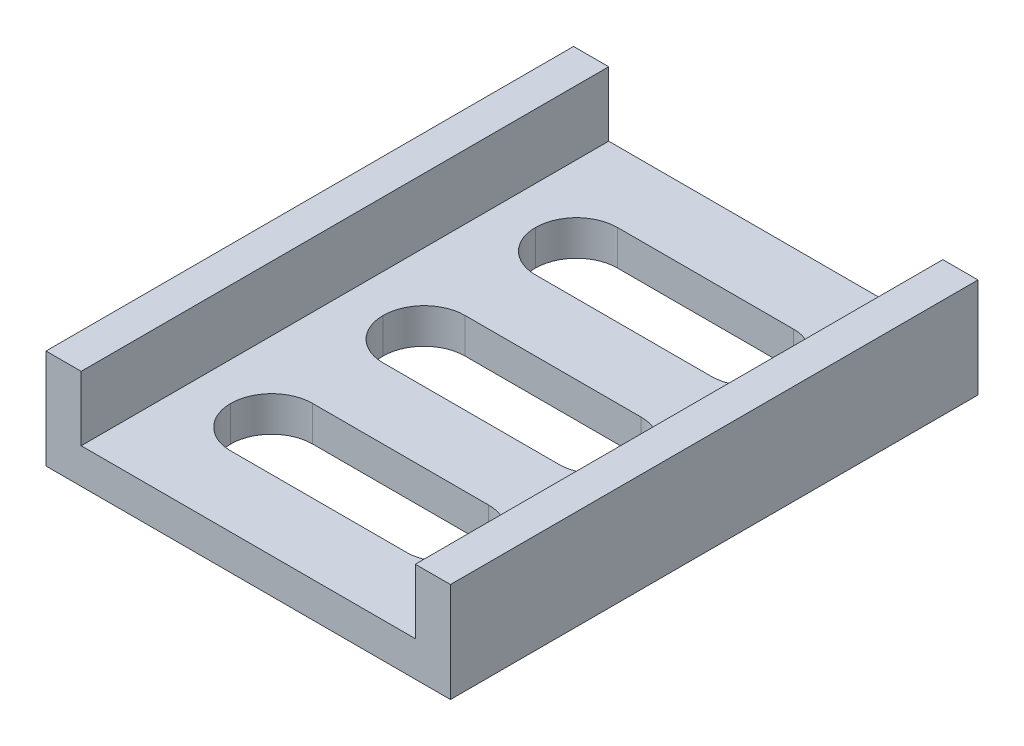
ISO-10303-21;
HEADER;
FILE_DESCRIPTION(('STEP AP214'),'2;1');
FILE_NAME('part.step','',(''),(''),'','','');
FILE_SCHEMA(('AUTOMOTIVE_DESIGN { 1 0 10303 214 1 1 1 1 }'));
ENDSEC;
DATA;
#1=APPLICATION_CONTEXT('core data for automotive mechanical design processes');
#2=APPLICATION_PROTOCOL_DEFINITION('international standard','automotive_design',2000,#1);
#3=PRODUCT_CONTEXT('',#1,'mechanical');
#4=PRODUCT('Part','Part','',(#3));
#5=PRODUCT_RELATED_PRODUCT_CATEGORY('part','',(#4));
#6=PRODUCT_DEFINITION_FORMATION('','',#4);
#7=PRODUCT_DEFINITION_CONTEXT('part definition',#1,'design');
#8=PRODUCT_DEFINITION('design','',#6,#7);
#9=PRODUCT_DEFINITION_SHAPE('','',#8);
#10=(LENGTH_UNIT() NAMED_UNIT(*) SI_UNIT(.MILLI.,.METRE.));
#11=(NAMED_UNIT(*) PLANE_ANGLE_UNIT() SI_UNIT($,.RADIAN.));
#12=(NAMED_UNIT(*) SI_UNIT($,.STERADIAN.) SOLID_ANGLE_UNIT());
#13=UNCERTAINTY_MEASURE_WITH_UNIT(LENGTH_MEASURE(1.E-05),#10,'distance_accuracy_value','');
#14=(GEOMETRIC_REPRESENTATION_CONTEXT(3) GLOBAL_UNCERTAINTY_ASSIGNED_CONTEXT((#13)) GLOBAL_UNIT_ASSIGNED_CONTEXT((#10,
#11,#12)) REPRESENTATION_CONTEXT('',''));
#15=CARTESIAN_POINT('',(0.,0.,0.));
#16=DIRECTION('',(0.,0.,1.));
#17=DIRECTION('',(1.,0.,0.));
#18=AXIS2_PLACEMENT_3D('',#15,#16,#17);
#19=CARTESIAN_POINT('',(0.,3.,0.));
#20=DIRECTION('',(0.,-1.,0.));
#21=DIRECTION('',(0.,0.,-1.));
#22=AXIS2_PLACEMENT_3D('',#19,#20,#21);
#23=PLANE('',#22);
#24=CARTESIAN_POINT('',(-7.49999999999998,3.,-13.));
#25=DIRECTION('',(0.,-1.,0.));
#26=DIRECTION('',(0.,0.,-1.));
#27=AXIS2_PLACEMENT_3D('',#24,#25,#26);
#28=CIRCLE('',#27,3.5);
#29=CARTESIAN_POINT('',(-7.49999999999998,3.,-9.5));
#30=VERTEX_POINT('',#29);
#31=CARTESIAN_POINT('',(-11.,3.,-13.));
#32=VERTEX_POINT('',#31);
#33=EDGE_CURVE('E307',#30,#32,#28,.T.);
#34=ORIENTED_EDGE('',*,*,#33,.T.);
#35=CARTESIAN_POINT('',(-7.49999999999998,3.,-13.));
#36=DIRECTION('',(0.,-1.,0.));
#37=DIRECTION('',(0.,0.,-1.));
#38=AXIS2_PLACEMENT_3D('',#35,#36,#37);
#39=CIRCLE('',#38,3.5);
#40=CARTESIAN_POINT('',(-7.49999999999998,3.,-16.5));
#41=VERTEX_POINT('',#40);
#42=EDGE_CURVE('E311',#32,#41,#39,.T.);
#43=ORIENTED_EDGE('',*,*,#42,.T.);
#44=DIRECTION('',(1.,0.,0.));
#45=VECTOR('',#44,1.);
#46=CARTESIAN_POINT('',(0.,3.,-16.5));
#47=LINE('',#46,#45);
#48=CARTESIAN_POINT('',(7.50000000000002,3.,-16.5));
#49=VERTEX_POINT('',#48);
#50=EDGE_CURVE('E732',#41,#49,#47,.T.);
#51=ORIENTED_EDGE('',*,*,#50,.T.);
#52=CARTESIAN_POINT('',(7.50000000000002,3.,-13.));
#53=DIRECTION('',(0.,-1.,0.));
#54=DIRECTION('',(0.,0.,-1.));
#55=AXIS2_PLACEMENT_3D('',#52,#53,#54);
#56=CIRCLE('',#55,3.5);
#57=CARTESIAN_POINT('',(11.,3.,-13.));
#58=VERTEX_POINT('',#57);
#59=EDGE_CURVE('E319',#49,#58,#56,.T.);
#60=ORIENTED_EDGE('',*,*,#59,.T.);
#61=CARTESIAN_POINT('',(7.50000000000002,3.,-13.));
#62=DIRECTION('',(0.,-1.,0.));
#63=DIRECTION('',(0.,0.,-1.));
#64=AXIS2_PLACEMENT_3D('',#61,#62,#63);
#65=CIRCLE('',#64,3.5);
#66=CARTESIAN_POINT('',(7.50000000000002,3.,-9.5));
#67=VERTEX_POINT('',#66);
#68=EDGE_CURVE('E315',#58,#67,#65,.T.);
#69=ORIENTED_EDGE('',*,*,#68,.T.);
#70=DIRECTION('',(-1.,0.,0.));
#71=VECTOR('',#70,1.);
#72=CARTESIAN_POINT('',(0.,3.,-9.5));
#73=LINE('',#72,#71);
#74=EDGE_CURVE('E735',#67,#30,#73,.T.);
#75=ORIENTED_EDGE('',*,*,#74,.T.);
#76=EDGE_LOOP('',(#34,#43,#51,#60,#69,#75));
#77=FACE_BOUND('',#76,.T.);
#78=DIRECTION('',(-1.,0.,0.));
#79=VECTOR('',#78,1.);
#80=CARTESIAN_POINT('',(0.,3.,3.5));
#81=LINE('',#80,#79);
#82=CARTESIAN_POINT('',(7.5,3.,3.5));
#83=VERTEX_POINT('',#82);
#84=CARTESIAN_POINT('',(-7.5,3.,3.5));
#85=VERTEX_POINT('',#84);
#86=EDGE_CURVE('E390',#83,#85,#81,.T.);
#87=ORIENTED_EDGE('',*,*,#86,.T.);
#88=CARTESIAN_POINT('',(-7.5,3.,0.));
#89=DIRECTION('',(0.,-1.,0.));
#90=DIRECTION('',(0.,0.,-1.));
#91=AXIS2_PLACEMENT_3D('',#88,#89,#90);
#92=CIRCLE('',#91,3.5);
#93=CARTESIAN_POINT('',(-11.,3.,0.));
#94=VERTEX_POINT('',#93);
#95=EDGE_CURVE('E331',#85,#94,#92,.T.);
#96=ORIENTED_EDGE('',*,*,#95,.T.);
#97=CARTESIAN_POINT('',(-7.5,3.,0.));
#98=DIRECTION('',(0.,-1.,0.));
#99=DIRECTION('',(0.,0.,-1.));
#100=AXIS2_PLACEMENT_3D('',#97,#98,#99);
#101=CIRCLE('',#100,3.5);
#102=CARTESIAN_POINT('',(-7.5,3.,-3.5));
#103=VERTEX_POINT('',#102);
#104=EDGE_CURVE('E327',#94,#103,#101,.T.);
#105=ORIENTED_EDGE('',*,*,#104,.T.);
#106=DIRECTION('',(1.,0.,0.));
#107=VECTOR('',#106,1.);
#108=CARTESIAN_POINT('',(0.,3.,-3.5));
#109=LINE('',#108,#107);
#110=CARTESIAN_POINT('',(7.5,3.,-3.5));
#111=VERTEX_POINT('',#110);
#112=EDGE_CURVE('E384',#103,#111,#109,.T.);
#113=ORIENTED_EDGE('',*,*,#112,.T.);
#114=CARTESIAN_POINT('',(7.5,3.,0.));
#115=DIRECTION('',(0.,-1.,0.));
#116=DIRECTION('',(0.,0.,-1.));
#117=AXIS2_PLACEMENT_3D('',#114,#115,#116);
#118=CIRCLE('',#117,3.5);
#119=CARTESIAN_POINT('',(11.,3.,0.));
#120=VERTEX_POINT('',#119);
#121=EDGE_CURVE('E323',#111,#120,#118,.T.);
#122=ORIENTED_EDGE('',*,*,#121,.T.);
#123=CARTESIAN_POINT('',(7.5,3.,0.));
#124=DIRECTION('',(0.,-1.,0.));
#125=DIRECTION('',(0.,0.,-1.));
#126=AXIS2_PLACEMENT_3D('',#123,#124,#125);
#127=CIRCLE('',#126,3.5);
#128=EDGE_CURVE('E335',#120,#83,#127,.T.);
#129=ORIENTED_EDGE('',*,*,#128,.T.);
#130=EDGE_LOOP('',(#87,#96,#105,#113,#122,#129));
#131=FACE_BOUND('',#130,.T.);
#132=DIRECTION('',(-1.,0.,0.));
#133=VECTOR('',#132,1.);
#134=CARTESIAN_POINT('',(0.,3.,16.5));
#135=LINE('',#134,#133);
#136=CARTESIAN_POINT('',(7.50000000000001,3.,16.5));
#137=VERTEX_POINT('',#136);
#138=CARTESIAN_POINT('',(-7.49999999999999,3.,16.5));
#139=VERTEX_POINT('',#138);
#140=EDGE_CURVE('E387',#137,#139,#135,.T.);
#141=ORIENTED_EDGE('',*,*,#140,.T.);
#142=CARTESIAN_POINT('',(-7.49999999999999,3.,13.));
#143=DIRECTION('',(0.,-1.,0.));
#144=DIRECTION('',(0.,0.,-1.));
#145=AXIS2_PLACEMENT_3D('',#142,#143,#144);
#146=CIRCLE('',#145,3.5);
#147=CARTESIAN_POINT('',(-11.,3.,13.));
#148=VERTEX_POINT('',#147);
#149=EDGE_CURVE('E11',#139,#148,#146,.T.);
#150=ORIENTED_EDGE('',*,*,#149,.T.);
#151=CARTESIAN_POINT('',(-7.49999999999999,3.,13.));
#152=DIRECTION('',(0.,-1.,0.));
#153=DIRECTION('',(0.,0.,-1.));
#154=AXIS2_PLACEMENT_3D('',#151,#152,#153);
#155=CIRCLE('',#154,3.5);
#156=CARTESIAN_POINT('',(-7.49999999999999,3.,9.5));
#157=VERTEX_POINT('',#156);
#158=EDGE_CURVE('E346',#148,#157,#155,.T.);
#159=ORIENTED_EDGE('',*,*,#158,.T.);
#160=DIRECTION('',(1.,0.,0.));
#161=VECTOR('',#160,1.);
#162=CARTESIAN_POINT('',(0.,3.,9.5));
#163=LINE('',#162,#161);
#164=CARTESIAN_POINT('',(7.50000000000001,3.,9.5));
#165=VERTEX_POINT('',#164);
#166=EDGE_CURVE('E395',#157,#165,#163,.T.);
#167=ORIENTED_EDGE('',*,*,#166,.T.);
#168=CARTESIAN_POINT('',(7.50000000000001,3.,13.));
#169=DIRECTION('',(0.,-1.,0.));
#170=DIRECTION('',(0.,0.,-1.));
#171=AXIS2_PLACEMENT_3D('',#168,#169,#170);
#172=CIRCLE('',#171,3.5);
#173=CARTESIAN_POINT('',(11.,3.,13.));
#174=VERTEX_POINT('',#173);
#175=EDGE_CURVE('E339',#165,#174,#172,.T.);
#176=ORIENTED_EDGE('',*,*,#175,.T.);
#177=CARTESIAN_POINT('',(7.50000000000001,3.,13.));
#178=DIRECTION('',(0.,-1.,0.));
#179=DIRECTION('',(0.,0.,-1.));
#180=AXIS2_PLACEMENT_3D('',#177,#178,#179);
#181=CIRCLE('',#180,3.5);
#182=EDGE_CURVE('E343',#174,#137,#181,.T.);
#183=ORIENTED_EDGE('',*,*,#182,.T.);
#184=EDGE_LOOP('',(#141,#150,#159,#167,#176,#183));
#185=FACE_BOUND('',#184,.T.);
#186=DIRECTION('',(0.,0.,1.));
#187=VECTOR('',#186,1.);
#188=CARTESIAN_POINT('',(14.25,3.,-22.5));
#189=LINE('',#188,#187);
#190=CARTESIAN_POINT('',(14.25,3.,-22.5));
#191=VERTEX_POINT('',#190);
#192=CARTESIAN_POINT('',(14.25,3.,22.5));
#193=VERTEX_POINT('',#192);
#194=EDGE_CURVE('E231',#191,#193,#189,.T.);
#195=ORIENTED_EDGE('',*,*,#194,.F.);
#196=DIRECTION('',(-1.,0.,0.));
#197=VECTOR('',#196,1.);
#198=CARTESIAN_POINT('',(-17.25,3.,-22.5));
#199=LINE('',#198,#197);
#200=CARTESIAN_POINT('',(-14.25,3.,-22.5));
#201=VERTEX_POINT('',#200);
#202=EDGE_CURVE('E236',#191,#201,#199,.T.);
#203=ORIENTED_EDGE('',*,*,#202,.T.);
#204=DIRECTION('',(0.,0.,-1.));
#205=VECTOR('',#204,1.);
#206=CARTESIAN_POINT('',(-14.25,3.,-22.5));
#207=LINE('',#206,#205);
#208=CARTESIAN_POINT('',(-14.25,3.,22.5));
#209=VERTEX_POINT('',#208);
#210=EDGE_CURVE('E237',#209,#201,#207,.T.);
#211=ORIENTED_EDGE('',*,*,#210,.F.);
#212=DIRECTION('',(1.,0.,0.));
#213=VECTOR('',#212,1.);
#214=CARTESIAN_POINT('',(-17.25,3.,22.5));
#215=LINE('',#214,#213);
#216=EDGE_CURVE('E261',#209,#193,#215,.T.);
#217=ORIENTED_EDGE('',*,*,#216,.T.);
#218=EDGE_LOOP('',(#195,#203,#211,#217));
#219=FACE_BOUND('',#218,.T.);
#220=ADVANCED_FACE('F36',(#77,#131,#185,#219),#23,.F.);
#221=CARTESIAN_POINT('',(17.25,3.,22.5));
#222=DIRECTION('',(-1.,0.,0.));
#223=DIRECTION('',(0.,0.,1.));
#224=AXIS2_PLACEMENT_3D('',#221,#222,#223);
#225=PLANE('',#224);
#226=DIRECTION('',(0.,0.,-1.));
#227=VECTOR('',#226,1.);
#228=CARTESIAN_POINT('',(17.25,0.,22.5));
#229=LINE('',#228,#227);
#230=CARTESIAN_POINT('',(17.25,0.,22.5));
#231=VERTEX_POINT('',#230);
#232=CARTESIAN_POINT('',(17.25,0.,-22.5));
#233=VERTEX_POINT('',#232);
#234=EDGE_CURVE('E269',#231,#233,#229,.T.);
#235=ORIENTED_EDGE('',*,*,#234,.T.);
#236=DIRECTION('',(0.,-1.,0.));
#237=VECTOR('',#236,1.);
#238=CARTESIAN_POINT('',(17.25,3.,-22.5));
#239=LINE('',#238,#237);
#240=CARTESIAN_POINT('',(17.25,8.5,-22.5));
#241=VERTEX_POINT('',#240);
#242=EDGE_CURVE('E278',#241,#233,#239,.T.);
#243=ORIENTED_EDGE('',*,*,#242,.F.);
#244=DIRECTION('',(0.,0.,-1.));
#245=VECTOR('',#244,1.);
#246=CARTESIAN_POINT('',(17.25,8.5,-22.5));
#247=LINE('',#246,#245);
#248=CARTESIAN_POINT('',(17.25,8.5,22.5));
#249=VERTEX_POINT('',#248);
#250=EDGE_CURVE('E228',#249,#241,#247,.T.);
#251=ORIENTED_EDGE('',*,*,#250,.F.);
#252=DIRECTION('',(0.,-1.,0.));
#253=VECTOR('',#252,1.);
#254=CARTESIAN_POINT('',(17.25,3.,22.5));
#255=LINE('',#254,#253);
#256=EDGE_CURVE('E405',#249,#231,#255,.T.);
#257=ORIENTED_EDGE('',*,*,#256,.T.);
#258=EDGE_LOOP('',(#235,#243,#251,#257));
#259=FACE_BOUND('',#258,.T.);
#260=ADVANCED_FACE('F408',(#259),#225,.F.);
#261=CARTESIAN_POINT('',(-17.25,3.,-22.5));
#262=DIRECTION('',(0.,0.,1.));
#263=DIRECTION('',(1.,0.,0.));
#264=AXIS2_PLACEMENT_3D('',#261,#262,#263);
#265=PLANE('',#264);
#266=DIRECTION('',(-1.,0.,0.));
#267=VECTOR('',#266,1.);
#268=CARTESIAN_POINT('',(-17.25,0.,-22.5));
#269=LINE('',#268,#267);
#270=CARTESIAN_POINT('',(-17.25,0.,-22.5));
#271=VERTEX_POINT('',#270);
#272=EDGE_CURVE('E421',#233,#271,#269,.T.);
#273=ORIENTED_EDGE('',*,*,#272,.T.);
#274=DIRECTION('',(0.,-1.,0.));
#275=VECTOR('',#274,1.);
#276=CARTESIAN_POINT('',(-17.25,3.,-22.5));
#277=LINE('',#276,#275);
#278=CARTESIAN_POINT('',(-17.25,8.5,-22.5));
#279=VERTEX_POINT('',#278);
#280=EDGE_CURVE('E410',#279,#271,#277,.T.);
#281=ORIENTED_EDGE('',*,*,#280,.F.);
#282=DIRECTION('',(-1.,0.,0.));
#283=VECTOR('',#282,1.);
#284=CARTESIAN_POINT('',(-14.25,8.5,-22.5));
#285=LINE('',#284,#283);
#286=CARTESIAN_POINT('',(-14.25,8.5,-22.5));
#287=VERTEX_POINT('',#286);
#288=EDGE_CURVE('E240',#287,#279,#285,.T.);
#289=ORIENTED_EDGE('',*,*,#288,.F.);
#290=DIRECTION('',(0.,-1.,0.));
#291=VECTOR('',#290,1.);
#292=CARTESIAN_POINT('',(-14.25,8.5,-22.5));
#293=LINE('',#292,#291);
#294=EDGE_CURVE('E254',#287,#201,#293,.T.);
#295=ORIENTED_EDGE('',*,*,#294,.T.);
#296=ORIENTED_EDGE('',*,*,#202,.F.);
#297=DIRECTION('',(0.,-1.,0.));
#298=VECTOR('',#297,1.);
#299=CARTESIAN_POINT('',(14.25,8.5,-22.5));
#300=LINE('',#299,#298);
#301=CARTESIAN_POINT('',(14.25,8.5,-22.5));
#302=VERTEX_POINT('',#301);
#303=EDGE_CURVE('E215',#302,#191,#300,.T.);
#304=ORIENTED_EDGE('',*,*,#303,.F.);
#305=DIRECTION('',(-1.,0.,0.));
#306=VECTOR('',#305,1.);
#307=CARTESIAN_POINT('',(14.25,8.5,-22.5));
#308=LINE('',#307,#306);
#309=EDGE_CURVE('E222',#241,#302,#308,.T.);
#310=ORIENTED_EDGE('',*,*,#309,.F.);
#311=ORIENTED_EDGE('',*,*,#242,.T.);
#312=EDGE_LOOP('',(#273,#281,#289,#295,#296,#304,#310,#311));
#313=FACE_BOUND('',#312,.T.);
#314=ADVANCED_FACE('F234',(#313),#265,.F.);
#315=CARTESIAN_POINT('',(-17.25,3.,22.5));
#316=DIRECTION('',(1.,0.,0.));
#317=DIRECTION('',(0.,0.,-1.));
#318=AXIS2_PLACEMENT_3D('',#315,#316,#317);
#319=PLANE('',#318);
#320=DIRECTION('',(0.,0.,1.));
#321=VECTOR('',#320,1.);
#322=CARTESIAN_POINT('',(-17.25,0.,22.5));
#323=LINE('',#322,#321);
#324=CARTESIAN_POINT('',(-17.25,0.,22.5));
#325=VERTEX_POINT('',#324);
#326=EDGE_CURVE('E419',#271,#325,#323,.T.);
#327=ORIENTED_EDGE('',*,*,#326,.T.);
#328=DIRECTION('',(0.,-1.,0.));
#329=VECTOR('',#328,1.);
#330=CARTESIAN_POINT('',(-17.25,3.,22.5));
#331=LINE('',#330,#329);
#332=CARTESIAN_POINT('',(-17.25,8.5,22.5));
#333=VERTEX_POINT('',#332);
#334=EDGE_CURVE('E412',#333,#325,#331,.T.);
#335=ORIENTED_EDGE('',*,*,#334,.F.);
#336=DIRECTION('',(0.,0.,1.));
#337=VECTOR('',#336,1.);
#338=CARTESIAN_POINT('',(-17.25,8.5,-22.5));
#339=LINE('',#338,#337);
#340=EDGE_CURVE('E247',#279,#333,#339,.T.);
#341=ORIENTED_EDGE('',*,*,#340,.F.);
#342=ORIENTED_EDGE('',*,*,#280,.T.);
#343=EDGE_LOOP('',(#327,#335,#341,#342));
#344=FACE_BOUND('',#343,.T.);
#345=ADVANCED_FACE('F428',(#344),#319,.F.);
#346=CARTESIAN_POINT('',(-17.25,3.,22.5));
#347=DIRECTION('',(0.,0.,-1.));
#348=DIRECTION('',(-1.,0.,0.));
#349=AXIS2_PLACEMENT_3D('',#346,#347,#348);
#350=PLANE('',#349);
#351=DIRECTION('',(1.,0.,0.));
#352=VECTOR('',#351,1.);
#353=CARTESIAN_POINT('',(-17.25,0.,22.5));
#354=LINE('',#353,#352);
#355=EDGE_CURVE('E273',#325,#231,#354,.T.);
#356=ORIENTED_EDGE('',*,*,#355,.T.);
#357=ORIENTED_EDGE('',*,*,#256,.F.);
#358=DIRECTION('',(1.,0.,0.));
#359=VECTOR('',#358,1.);
#360=CARTESIAN_POINT('',(17.25,8.5,22.5));
#361=LINE('',#360,#359);
#362=CARTESIAN_POINT('',(14.25,8.5,22.5));
#363=VERTEX_POINT('',#362);
#364=EDGE_CURVE('E221',#363,#249,#361,.T.);
#365=ORIENTED_EDGE('',*,*,#364,.F.);
#366=DIRECTION('',(0.,-1.,0.));
#367=VECTOR('',#366,1.);
#368=CARTESIAN_POINT('',(14.25,8.5,22.5));
#369=LINE('',#368,#367);
#370=EDGE_CURVE('E217',#363,#193,#369,.T.);
#371=ORIENTED_EDGE('',*,*,#370,.T.);
#372=ORIENTED_EDGE('',*,*,#216,.F.);
#373=DIRECTION('',(0.,-1.,0.));
#374=VECTOR('',#373,1.);
#375=CARTESIAN_POINT('',(-14.25,8.5,22.5));
#376=LINE('',#375,#374);
#377=CARTESIAN_POINT('',(-14.25,8.5,22.5));
#378=VERTEX_POINT('',#377);
#379=EDGE_CURVE('E264',#378,#209,#376,.T.);
#380=ORIENTED_EDGE('',*,*,#379,.F.);
#381=DIRECTION('',(1.,0.,0.));
#382=VECTOR('',#381,1.);
#383=CARTESIAN_POINT('',(-17.25,8.5,22.5));
#384=LINE('',#383,#382);
#385=EDGE_CURVE('E250',#333,#378,#384,.T.);
#386=ORIENTED_EDGE('',*,*,#385,.F.);
#387=ORIENTED_EDGE('',*,*,#334,.T.);
#388=EDGE_LOOP('',(#356,#357,#365,#371,#372,#380,#386,#387));
#389=FACE_BOUND('',#388,.T.);
#390=ADVANCED_FACE('F402',(#389),#350,.F.);
#391=CARTESIAN_POINT('',(0.,0.,0.));
#392=DIRECTION('',(0.,-1.,0.));
#393=DIRECTION('',(0.,0.,-1.));
#394=AXIS2_PLACEMENT_3D('',#391,#392,#393);
#395=PLANE('',#394);
#396=CARTESIAN_POINT('',(7.50000000000002,0.,-13.));
#397=DIRECTION('',(0.,-1.,0.));
#398=DIRECTION('',(0.,0.,-1.));
#399=AXIS2_PLACEMENT_3D('',#396,#397,#398);
#400=CIRCLE('',#399,3.5);
#401=CARTESIAN_POINT('',(7.50000000000002,0.,-9.5));
#402=VERTEX_POINT('',#401);
#403=CARTESIAN_POINT('',(11.,0.,-13.));
#404=VERTEX_POINT('',#403);
#405=EDGE_CURVE('E313',#402,#404,#400,.F.);
#406=ORIENTED_EDGE('',*,*,#405,.T.);
#407=CARTESIAN_POINT('',(7.50000000000002,0.,-13.));
#408=DIRECTION('',(0.,-1.,0.));
#409=DIRECTION('',(0.,0.,-1.));
#410=AXIS2_PLACEMENT_3D('',#407,#408,#409);
#411=CIRCLE('',#410,3.5);
#412=CARTESIAN_POINT('',(7.50000000000002,0.,-16.5));
#413=VERTEX_POINT('',#412);
#414=EDGE_CURVE('E317',#404,#413,#411,.F.);
#415=ORIENTED_EDGE('',*,*,#414,.T.);
#416=DIRECTION('',(1.,0.,0.));
#417=VECTOR('',#416,1.);
#418=CARTESIAN_POINT('',(-11.,0.,-16.5));
#419=LINE('',#418,#417);
#420=CARTESIAN_POINT('',(-7.49999999999998,0.,-16.5));
#421=VERTEX_POINT('',#420);
#422=EDGE_CURVE('E743',#421,#413,#419,.T.);
#423=ORIENTED_EDGE('',*,*,#422,.F.);
#424=CARTESIAN_POINT('',(-7.49999999999998,0.,-13.));
#425=DIRECTION('',(0.,-1.,0.));
#426=DIRECTION('',(0.,0.,-1.));
#427=AXIS2_PLACEMENT_3D('',#424,#425,#426);
#428=CIRCLE('',#427,3.5);
#429=CARTESIAN_POINT('',(-11.,0.,-13.));
#430=VERTEX_POINT('',#429);
#431=EDGE_CURVE('E309',#421,#430,#428,.F.);
#432=ORIENTED_EDGE('',*,*,#431,.T.);
#433=CARTESIAN_POINT('',(-7.49999999999998,0.,-13.));
#434=DIRECTION('',(0.,-1.,0.));
#435=DIRECTION('',(0.,0.,-1.));
#436=AXIS2_PLACEMENT_3D('',#433,#434,#435);
#437=CIRCLE('',#436,3.5);
#438=CARTESIAN_POINT('',(-7.49999999999998,0.,-9.5));
#439=VERTEX_POINT('',#438);
#440=EDGE_CURVE('E305',#430,#439,#437,.F.);
#441=ORIENTED_EDGE('',*,*,#440,.T.);
#442=DIRECTION('',(-1.,0.,0.));
#443=VECTOR('',#442,1.);
#444=CARTESIAN_POINT('',(-11.,0.,-9.5));
#445=LINE('',#444,#443);
#446=EDGE_CURVE('E352',#402,#439,#445,.T.);
#447=ORIENTED_EDGE('',*,*,#446,.F.);
#448=EDGE_LOOP('',(#406,#415,#423,#432,#441,#447));
#449=FACE_BOUND('',#448,.T.);
#450=DIRECTION('',(-1.,0.,0.));
#451=VECTOR('',#450,1.);
#452=CARTESIAN_POINT('',(-11.,0.,3.5));
#453=LINE('',#452,#451);
#454=CARTESIAN_POINT('',(7.5,0.,3.5));
#455=VERTEX_POINT('',#454);
#456=CARTESIAN_POINT('',(-7.5,0.,3.5));
#457=VERTEX_POINT('',#456);
#458=EDGE_CURVE('E719',#455,#457,#453,.T.);
#459=ORIENTED_EDGE('',*,*,#458,.F.);
#460=CARTESIAN_POINT('',(7.5,0.,0.));
#461=DIRECTION('',(0.,-1.,0.));
#462=DIRECTION('',(0.,0.,-1.));
#463=AXIS2_PLACEMENT_3D('',#460,#461,#462);
#464=CIRCLE('',#463,3.5);
#465=CARTESIAN_POINT('',(11.,0.,0.));
#466=VERTEX_POINT('',#465);
#467=EDGE_CURVE('E333',#455,#466,#464,.F.);
#468=ORIENTED_EDGE('',*,*,#467,.T.);
#469=CARTESIAN_POINT('',(7.5,0.,0.));
#470=DIRECTION('',(0.,-1.,0.));
#471=DIRECTION('',(0.,0.,-1.));
#472=AXIS2_PLACEMENT_3D('',#469,#470,#471);
#473=CIRCLE('',#472,3.5);
#474=CARTESIAN_POINT('',(7.5,0.,-3.5));
#475=VERTEX_POINT('',#474);
#476=EDGE_CURVE('E321',#466,#475,#473,.F.);
#477=ORIENTED_EDGE('',*,*,#476,.T.);
#478=DIRECTION('',(1.,0.,0.));
#479=VECTOR('',#478,1.);
#480=CARTESIAN_POINT('',(-11.,0.,-3.5));
#481=LINE('',#480,#479);
#482=CARTESIAN_POINT('',(-7.5,0.,-3.5));
#483=VERTEX_POINT('',#482);
#484=EDGE_CURVE('E714',#483,#475,#481,.T.);
#485=ORIENTED_EDGE('',*,*,#484,.F.);
#486=CARTESIAN_POINT('',(-7.5,0.,0.));
#487=DIRECTION('',(0.,-1.,0.));
#488=DIRECTION('',(0.,0.,-1.));
#489=AXIS2_PLACEMENT_3D('',#486,#487,#488);
#490=CIRCLE('',#489,3.5);
#491=CARTESIAN_POINT('',(-11.,0.,0.));
#492=VERTEX_POINT('',#491);
#493=EDGE_CURVE('E325',#483,#492,#490,.F.);
#494=ORIENTED_EDGE('',*,*,#493,.T.);
#495=CARTESIAN_POINT('',(-7.5,0.,0.));
#496=DIRECTION('',(0.,-1.,0.));
#497=DIRECTION('',(0.,0.,-1.));
#498=AXIS2_PLACEMENT_3D('',#495,#496,#497);
#499=CIRCLE('',#498,3.5);
#500=EDGE_CURVE('E329',#492,#457,#499,.F.);
#501=ORIENTED_EDGE('',*,*,#500,.T.);
#502=EDGE_LOOP('',(#459,#468,#477,#485,#494,#501));
#503=FACE_BOUND('',#502,.T.);
#504=DIRECTION('',(-1.,0.,0.));
#505=VECTOR('',#504,1.);
#506=CARTESIAN_POINT('',(-11.,0.,16.5));
#507=LINE('',#506,#505);
#508=CARTESIAN_POINT('',(7.50000000000001,0.,16.5));
#509=VERTEX_POINT('',#508);
#510=CARTESIAN_POINT('',(-7.49999999999999,0.,16.5));
#511=VERTEX_POINT('',#510);
#512=EDGE_CURVE('E377',#509,#511,#507,.T.);
#513=ORIENTED_EDGE('',*,*,#512,.F.);
#514=CARTESIAN_POINT('',(7.50000000000001,0.,13.));
#515=DIRECTION('',(0.,-1.,0.));
#516=DIRECTION('',(0.,0.,-1.));
#517=AXIS2_PLACEMENT_3D('',#514,#515,#516);
#518=CIRCLE('',#517,3.5);
#519=CARTESIAN_POINT('',(11.,0.,13.));
#520=VERTEX_POINT('',#519);
#521=EDGE_CURVE('E341',#509,#520,#518,.F.);
#522=ORIENTED_EDGE('',*,*,#521,.T.);
#523=CARTESIAN_POINT('',(7.50000000000001,0.,13.));
#524=DIRECTION('',(0.,-1.,0.));
#525=DIRECTION('',(0.,0.,-1.));
#526=AXIS2_PLACEMENT_3D('',#523,#524,#525);
#527=CIRCLE('',#526,3.5);
#528=CARTESIAN_POINT('',(7.50000000000001,0.,9.5));
#529=VERTEX_POINT('',#528);
#530=EDGE_CURVE('E337',#520,#529,#527,.F.);
#531=ORIENTED_EDGE('',*,*,#530,.T.);
#532=DIRECTION('',(1.,0.,0.));
#533=VECTOR('',#532,1.);
#534=CARTESIAN_POINT('',(-11.,0.,9.5));
#535=LINE('',#534,#533);
#536=CARTESIAN_POINT('',(-7.49999999999999,0.,9.5));
#537=VERTEX_POINT('',#536);
#538=EDGE_CURVE('E383',#537,#529,#535,.T.);
#539=ORIENTED_EDGE('',*,*,#538,.F.);
#540=CARTESIAN_POINT('',(-7.49999999999999,0.,13.));
#541=DIRECTION('',(0.,-1.,0.));
#542=DIRECTION('',(0.,0.,-1.));
#543=AXIS2_PLACEMENT_3D('',#540,#541,#542);
#544=CIRCLE('',#543,3.5);
#545=CARTESIAN_POINT('',(-11.,0.,13.));
#546=VERTEX_POINT('',#545);
#547=EDGE_CURVE('E59',#537,#546,#544,.F.);
#548=ORIENTED_EDGE('',*,*,#547,.T.);
#549=CARTESIAN_POINT('',(-7.49999999999999,0.,13.));
#550=DIRECTION('',(0.,-1.,0.));
#551=DIRECTION('',(0.,0.,-1.));
#552=AXIS2_PLACEMENT_3D('',#549,#550,#551);
#553=CIRCLE('',#552,3.5);
#554=EDGE_CURVE('E45',#546,#511,#553,.F.);
#555=ORIENTED_EDGE('',*,*,#554,.T.);
#556=EDGE_LOOP('',(#513,#522,#531,#539,#548,#555));
#557=FACE_BOUND('',#556,.T.);
#558=ORIENTED_EDGE('',*,*,#234,.F.);
#559=ORIENTED_EDGE('',*,*,#355,.F.);
#560=ORIENTED_EDGE('',*,*,#326,.F.);
#561=ORIENTED_EDGE('',*,*,#272,.F.);
#562=EDGE_LOOP('',(#558,#559,#560,#561));
#563=FACE_BOUND('',#562,.T.);
#564=ADVANCED_FACE('F375',(#449,#503,#557,#563),#395,.T.);
#565=CARTESIAN_POINT('',(-14.25,8.5,-22.5));
#566=DIRECTION('',(-1.,0.,0.));
#567=DIRECTION('',(0.,0.,1.));
#568=AXIS2_PLACEMENT_3D('',#565,#566,#567);
#569=PLANE('',#568);
#570=ORIENTED_EDGE('',*,*,#210,.T.);
#571=ORIENTED_EDGE('',*,*,#294,.F.);
#572=DIRECTION('',(0.,0.,-1.));
#573=VECTOR('',#572,1.);
#574=CARTESIAN_POINT('',(-14.25,8.5,-22.5));
#575=LINE('',#574,#573);
#576=EDGE_CURVE('E252',#378,#287,#575,.T.);
#577=ORIENTED_EDGE('',*,*,#576,.F.);
#578=ORIENTED_EDGE('',*,*,#379,.T.);
#579=EDGE_LOOP('',(#570,#571,#577,#578));
#580=FACE_BOUND('',#579,.T.);
#581=ADVANCED_FACE('F436',(#580),#569,.F.);
#582=CARTESIAN_POINT('',(0.,8.5,0.));
#583=DIRECTION('',(0.,1.,0.));
#584=DIRECTION('',(0.,0.,1.));
#585=AXIS2_PLACEMENT_3D('',#582,#583,#584);
#586=PLANE('',#585);
#587=ORIENTED_EDGE('',*,*,#288,.T.);
#588=ORIENTED_EDGE('',*,*,#340,.T.);
#589=ORIENTED_EDGE('',*,*,#385,.T.);
#590=ORIENTED_EDGE('',*,*,#576,.T.);
#591=EDGE_LOOP('',(#587,#588,#589,#590));
#592=FACE_BOUND('',#591,.T.);
#593=ADVANCED_FACE('F432',(#592),#586,.T.);
#594=CARTESIAN_POINT('',(14.25,8.5,-22.5));
#595=DIRECTION('',(1.,0.,0.));
#596=DIRECTION('',(0.,0.,-1.));
#597=AXIS2_PLACEMENT_3D('',#594,#595,#596);
#598=PLANE('',#597);
#599=ORIENTED_EDGE('',*,*,#194,.T.);
#600=ORIENTED_EDGE('',*,*,#370,.F.);
#601=DIRECTION('',(0.,0.,1.));
#602=VECTOR('',#601,1.);
#603=CARTESIAN_POINT('',(14.25,8.5,-22.5));
#604=LINE('',#603,#602);
#605=EDGE_CURVE('E210',#302,#363,#604,.T.);
#606=ORIENTED_EDGE('',*,*,#605,.F.);
#607=ORIENTED_EDGE('',*,*,#303,.T.);
#608=EDGE_LOOP('',(#599,#600,#606,#607));
#609=FACE_BOUND('',#608,.T.);
#610=ADVANCED_FACE('F213',(#609),#598,.F.);
#611=CARTESIAN_POINT('',(0.,8.5,0.));
#612=DIRECTION('',(0.,-1.,0.));
#613=DIRECTION('',(0.,0.,-1.));
#614=AXIS2_PLACEMENT_3D('',#611,#612,#613);
#615=PLANE('',#614);
#616=ORIENTED_EDGE('',*,*,#309,.T.);
#617=ORIENTED_EDGE('',*,*,#605,.T.);
#618=ORIENTED_EDGE('',*,*,#364,.T.);
#619=ORIENTED_EDGE('',*,*,#250,.T.);
#620=EDGE_LOOP('',(#616,#617,#618,#619));
#621=FACE_BOUND('',#620,.T.);
#622=ADVANCED_FACE('F226',(#621),#615,.F.);
#623=CARTESIAN_POINT('',(-11.,8.,9.5));
#624=DIRECTION('',(0.,0.,-1.));
#625=DIRECTION('',(-1.,0.,0.));
#626=AXIS2_PLACEMENT_3D('',#623,#624,#625);
#627=PLANE('',#626);
#628=ORIENTED_EDGE('',*,*,#538,.T.);
#629=DIRECTION('',(0.,-1.,0.));
#630=VECTOR('',#629,1.);
#631=CARTESIAN_POINT('',(7.50000000000001,3.,9.5));
#632=LINE('',#631,#630);
#633=EDGE_CURVE('E298',#529,#165,#632,.F.);
#634=ORIENTED_EDGE('',*,*,#633,.T.);
#635=ORIENTED_EDGE('',*,*,#166,.F.);
#636=DIRECTION('',(0.,-1.,0.));
#637=VECTOR('',#636,1.);
#638=CARTESIAN_POINT('',(-7.49999999999999,0.,9.5));
#639=LINE('',#638,#637);
#640=EDGE_CURVE('E295',#157,#537,#639,.T.);
#641=ORIENTED_EDGE('',*,*,#640,.T.);
#642=EDGE_LOOP('',(#628,#634,#635,#641));
#643=FACE_BOUND('',#642,.T.);
#644=ADVANCED_FACE('F579',(#643),#627,.F.);
#645=CARTESIAN_POINT('',(-11.,8.,16.5));
#646=DIRECTION('',(0.,0.,1.));
#647=DIRECTION('',(1.,0.,0.));
#648=AXIS2_PLACEMENT_3D('',#645,#646,#647);
#649=PLANE('',#648);
#650=ORIENTED_EDGE('',*,*,#140,.F.);
#651=DIRECTION('',(0.,-1.,0.));
#652=VECTOR('',#651,1.);
#653=CARTESIAN_POINT('',(7.50000000000001,0.,16.5));
#654=LINE('',#653,#652);
#655=EDGE_CURVE('E303',#137,#509,#654,.T.);
#656=ORIENTED_EDGE('',*,*,#655,.T.);
#657=ORIENTED_EDGE('',*,*,#512,.T.);
#658=DIRECTION('',(0.,-1.,0.));
#659=VECTOR('',#658,1.);
#660=CARTESIAN_POINT('',(-7.49999999999999,3.,16.5));
#661=LINE('',#660,#659);
#662=EDGE_CURVE('E301',#511,#139,#661,.F.);
#663=ORIENTED_EDGE('',*,*,#662,.T.);
#664=EDGE_LOOP('',(#650,#656,#657,#663));
#665=FACE_BOUND('',#664,.T.);
#666=ADVANCED_FACE('F381',(#665),#649,.F.);
#667=CARTESIAN_POINT('',(-11.,8.,-3.5));
#668=DIRECTION('',(0.,0.,-1.));
#669=DIRECTION('',(-1.,0.,0.));
#670=AXIS2_PLACEMENT_3D('',#667,#668,#669);
#671=PLANE('',#670);
#672=ORIENTED_EDGE('',*,*,#484,.T.);
#673=DIRECTION('',(0.,-1.,0.));
#674=VECTOR('',#673,1.);
#675=CARTESIAN_POINT('',(7.5,3.,-3.5));
#676=LINE('',#675,#674);
#677=EDGE_CURVE('E288',#475,#111,#676,.F.);
#678=ORIENTED_EDGE('',*,*,#677,.T.);
#679=ORIENTED_EDGE('',*,*,#112,.F.);
#680=DIRECTION('',(0.,-1.,0.));
#681=VECTOR('',#680,1.);
#682=CARTESIAN_POINT('',(-7.5,0.,-3.5));
#683=LINE('',#682,#681);
#684=EDGE_CURVE('E285',#103,#483,#683,.T.);
#685=ORIENTED_EDGE('',*,*,#684,.T.);
#686=EDGE_LOOP('',(#672,#678,#679,#685));
#687=FACE_BOUND('',#686,.T.);
#688=ADVANCED_FACE('F564',(#687),#671,.F.);
#689=CARTESIAN_POINT('',(-11.,8.,3.5));
#690=DIRECTION('',(0.,0.,1.));
#691=DIRECTION('',(1.,0.,0.));
#692=AXIS2_PLACEMENT_3D('',#689,#690,#691);
#693=PLANE('',#692);
#694=ORIENTED_EDGE('',*,*,#458,.T.);
#695=DIRECTION('',(0.,-1.,0.));
#696=VECTOR('',#695,1.);
#697=CARTESIAN_POINT('',(-7.5,3.,3.5));
#698=LINE('',#697,#696);
#699=EDGE_CURVE('E293',#457,#85,#698,.F.);
#700=ORIENTED_EDGE('',*,*,#699,.T.);
#701=ORIENTED_EDGE('',*,*,#86,.F.);
#702=DIRECTION('',(0.,-1.,0.));
#703=VECTOR('',#702,1.);
#704=CARTESIAN_POINT('',(7.5,0.,3.5));
#705=LINE('',#704,#703);
#706=EDGE_CURVE('E291',#83,#455,#705,.T.);
#707=ORIENTED_EDGE('',*,*,#706,.T.);
#708=EDGE_LOOP('',(#694,#700,#701,#707));
#709=FACE_BOUND('',#708,.T.);
#710=ADVANCED_FACE('F556',(#709),#693,.F.);
#711=CARTESIAN_POINT('',(-11.,8.,-16.5));
#712=DIRECTION('',(0.,0.,-1.));
#713=DIRECTION('',(-1.,0.,0.));
#714=AXIS2_PLACEMENT_3D('',#711,#712,#713);
#715=PLANE('',#714);
#716=ORIENTED_EDGE('',*,*,#50,.F.);
#717=DIRECTION('',(0.,-1.,0.));
#718=VECTOR('',#717,1.);
#719=CARTESIAN_POINT('',(-7.49999999999998,0.,-16.5));
#720=LINE('',#719,#718);
#721=EDGE_CURVE('E283',#41,#421,#720,.T.);
#722=ORIENTED_EDGE('',*,*,#721,.T.);
#723=ORIENTED_EDGE('',*,*,#422,.T.);
#724=DIRECTION('',(0.,-1.,0.));
#725=VECTOR('',#724,1.);
#726=CARTESIAN_POINT('',(7.50000000000002,3.,-16.5));
#727=LINE('',#726,#725);
#728=EDGE_CURVE('E281',#413,#49,#727,.F.);
#729=ORIENTED_EDGE('',*,*,#728,.T.);
#730=EDGE_LOOP('',(#716,#722,#723,#729));
#731=FACE_BOUND('',#730,.T.);
#732=ADVANCED_FACE('F548',(#731),#715,.F.);
#733=CARTESIAN_POINT('',(-11.,8.,-9.5));
#734=DIRECTION('',(0.,0.,1.));
#735=DIRECTION('',(1.,0.,0.));
#736=AXIS2_PLACEMENT_3D('',#733,#734,#735);
#737=PLANE('',#736);
#738=ORIENTED_EDGE('',*,*,#446,.T.);
#739=DIRECTION('',(0.,-1.,0.));
#740=VECTOR('',#739,1.);
#741=CARTESIAN_POINT('',(-7.49999999999998,3.,-9.5));
#742=LINE('',#741,#740);
#743=EDGE_CURVE('E277',#439,#30,#742,.F.);
#744=ORIENTED_EDGE('',*,*,#743,.T.);
#745=ORIENTED_EDGE('',*,*,#74,.F.);
#746=DIRECTION('',(0.,-1.,0.));
#747=VECTOR('',#746,1.);
#748=CARTESIAN_POINT('',(7.50000000000002,0.,-9.5));
#749=LINE('',#748,#747);
#750=EDGE_CURVE('E274',#67,#402,#749,.T.);
#751=ORIENTED_EDGE('',*,*,#750,.T.);
#752=EDGE_LOOP('',(#738,#744,#745,#751));
#753=FACE_BOUND('',#752,.T.);
#754=ADVANCED_FACE('F465',(#753),#737,.F.);
#755=CARTESIAN_POINT('',(-7.49999999999998,8.,-13.));
#756=DIRECTION('',(0.,1.,0.));
#757=DIRECTION('',(0.,0.,1.));
#758=AXIS2_PLACEMENT_3D('',#755,#756,#757);
#759=CYLINDRICAL_SURFACE('',#758,3.5);
#760=ORIENTED_EDGE('',*,*,#721,.F.);
#761=ORIENTED_EDGE('',*,*,#42,.F.);
#762=DIRECTION('',(0.,-1.,0.));
#763=VECTOR('',#762,1.);
#764=CARTESIAN_POINT('',(-11.,3.,-13.));
#765=LINE('',#764,#763);
#766=EDGE_CURVE('E349',#430,#32,#765,.F.);
#767=ORIENTED_EDGE('',*,*,#766,.F.);
#768=ORIENTED_EDGE('',*,*,#431,.F.);
#769=EDGE_LOOP('',(#760,#761,#767,#768));
#770=FACE_BOUND('',#769,.T.);
#771=ADVANCED_FACE('F461',(#770),#759,.F.);
#772=CARTESIAN_POINT('',(-7.49999999999998,8.,-13.));
#773=DIRECTION('',(0.,1.,0.));
#774=DIRECTION('',(0.,0.,1.));
#775=AXIS2_PLACEMENT_3D('',#772,#773,#774);
#776=CYLINDRICAL_SURFACE('',#775,3.5);
#777=ORIENTED_EDGE('',*,*,#33,.F.);
#778=ORIENTED_EDGE('',*,*,#743,.F.);
#779=ORIENTED_EDGE('',*,*,#440,.F.);
#780=ORIENTED_EDGE('',*,*,#766,.T.);
#781=EDGE_LOOP('',(#777,#778,#779,#780));
#782=FACE_BOUND('',#781,.T.);
#783=ADVANCED_FACE('F457',(#782),#776,.F.);
#784=CARTESIAN_POINT('',(7.50000000000002,8.,-13.));
#785=DIRECTION('',(0.,1.,0.));
#786=DIRECTION('',(0.,0.,1.));
#787=AXIS2_PLACEMENT_3D('',#784,#785,#786);
#788=CYLINDRICAL_SURFACE('',#787,3.5);
#789=DIRECTION('',(0.,-1.,0.));
#790=VECTOR('',#789,1.);
#791=CARTESIAN_POINT('',(11.,0.,-13.));
#792=LINE('',#791,#790);
#793=EDGE_CURVE('E353',#58,#404,#792,.T.);
#794=ORIENTED_EDGE('',*,*,#793,.F.);
#795=ORIENTED_EDGE('',*,*,#59,.F.);
#796=ORIENTED_EDGE('',*,*,#728,.F.);
#797=ORIENTED_EDGE('',*,*,#414,.F.);
#798=EDGE_LOOP('',(#794,#795,#796,#797));
#799=FACE_BOUND('',#798,.T.);
#800=ADVANCED_FACE('F460',(#799),#788,.F.);
#801=CARTESIAN_POINT('',(7.50000000000002,8.,-13.));
#802=DIRECTION('',(0.,1.,0.));
#803=DIRECTION('',(0.,0.,1.));
#804=AXIS2_PLACEMENT_3D('',#801,#802,#803);
#805=CYLINDRICAL_SURFACE('',#804,3.5);
#806=ORIENTED_EDGE('',*,*,#68,.F.);
#807=ORIENTED_EDGE('',*,*,#793,.T.);
#808=ORIENTED_EDGE('',*,*,#405,.F.);
#809=ORIENTED_EDGE('',*,*,#750,.F.);
#810=EDGE_LOOP('',(#806,#807,#808,#809));
#811=FACE_BOUND('',#810,.T.);
#812=ADVANCED_FACE('F467',(#811),#805,.F.);
#813=CARTESIAN_POINT('',(7.5,8.,0.));
#814=DIRECTION('',(0.,1.,0.));
#815=DIRECTION('',(0.,0.,1.));
#816=AXIS2_PLACEMENT_3D('',#813,#814,#815);
#817=CYLINDRICAL_SURFACE('',#816,3.5);
#818=ORIENTED_EDGE('',*,*,#706,.F.);
#819=ORIENTED_EDGE('',*,*,#128,.F.);
#820=DIRECTION('',(0.,-1.,0.));
#821=VECTOR('',#820,1.);
#822=CARTESIAN_POINT('',(11.,3.,0.));
#823=LINE('',#822,#821);
#824=EDGE_CURVE('E356',#466,#120,#823,.F.);
#825=ORIENTED_EDGE('',*,*,#824,.F.);
#826=ORIENTED_EDGE('',*,*,#467,.F.);
#827=EDGE_LOOP('',(#818,#819,#825,#826));
#828=FACE_BOUND('',#827,.T.);
#829=ADVANCED_FACE('F470',(#828),#817,.F.);
#830=CARTESIAN_POINT('',(7.5,8.,0.));
#831=DIRECTION('',(0.,1.,0.));
#832=DIRECTION('',(0.,0.,1.));
#833=AXIS2_PLACEMENT_3D('',#830,#831,#832);
#834=CYLINDRICAL_SURFACE('',#833,3.5);
#835=ORIENTED_EDGE('',*,*,#121,.F.);
#836=ORIENTED_EDGE('',*,*,#677,.F.);
#837=ORIENTED_EDGE('',*,*,#476,.F.);
#838=ORIENTED_EDGE('',*,*,#824,.T.);
#839=EDGE_LOOP('',(#835,#836,#837,#838));
#840=FACE_BOUND('',#839,.T.);
#841=ADVANCED_FACE('F475',(#840),#834,.F.);
#842=CARTESIAN_POINT('',(-7.5,8.,0.));
#843=DIRECTION('',(0.,1.,0.));
#844=DIRECTION('',(0.,0.,1.));
#845=AXIS2_PLACEMENT_3D('',#842,#843,#844);
#846=CYLINDRICAL_SURFACE('',#845,3.5);
#847=DIRECTION('',(0.,-1.,0.));
#848=VECTOR('',#847,1.);
#849=CARTESIAN_POINT('',(-11.,0.,0.));
#850=LINE('',#849,#848);
#851=EDGE_CURVE('E359',#94,#492,#850,.T.);
#852=ORIENTED_EDGE('',*,*,#851,.F.);
#853=ORIENTED_EDGE('',*,*,#95,.F.);
#854=ORIENTED_EDGE('',*,*,#699,.F.);
#855=ORIENTED_EDGE('',*,*,#500,.F.);
#856=EDGE_LOOP('',(#852,#853,#854,#855));
#857=FACE_BOUND('',#856,.T.);
#858=ADVANCED_FACE('F478',(#857),#846,.F.);
#859=CARTESIAN_POINT('',(-7.5,8.,0.));
#860=DIRECTION('',(0.,1.,0.));
#861=DIRECTION('',(0.,0.,1.));
#862=AXIS2_PLACEMENT_3D('',#859,#860,#861);
#863=CYLINDRICAL_SURFACE('',#862,3.5);
#864=ORIENTED_EDGE('',*,*,#104,.F.);
#865=ORIENTED_EDGE('',*,*,#851,.T.);
#866=ORIENTED_EDGE('',*,*,#493,.F.);
#867=ORIENTED_EDGE('',*,*,#684,.F.);
#868=EDGE_LOOP('',(#864,#865,#866,#867));
#869=FACE_BOUND('',#868,.T.);
#870=ADVANCED_FACE('F483',(#869),#863,.F.);
#871=CARTESIAN_POINT('',(7.50000000000001,8.,13.));
#872=DIRECTION('',(0.,1.,0.));
#873=DIRECTION('',(0.,0.,1.));
#874=AXIS2_PLACEMENT_3D('',#871,#872,#873);
#875=CYLINDRICAL_SURFACE('',#874,3.5);
#876=ORIENTED_EDGE('',*,*,#655,.F.);
#877=ORIENTED_EDGE('',*,*,#182,.F.);
#878=DIRECTION('',(0.,-1.,0.));
#879=VECTOR('',#878,1.);
#880=CARTESIAN_POINT('',(11.,3.,13.));
#881=LINE('',#880,#879);
#882=EDGE_CURVE('E361',#520,#174,#881,.F.);
#883=ORIENTED_EDGE('',*,*,#882,.F.);
#884=ORIENTED_EDGE('',*,*,#521,.F.);
#885=EDGE_LOOP('',(#876,#877,#883,#884));
#886=FACE_BOUND('',#885,.T.);
#887=ADVANCED_FACE('F486',(#886),#875,.F.);
#888=CARTESIAN_POINT('',(7.50000000000001,8.,13.));
#889=DIRECTION('',(0.,1.,0.));
#890=DIRECTION('',(0.,0.,1.));
#891=AXIS2_PLACEMENT_3D('',#888,#889,#890);
#892=CYLINDRICAL_SURFACE('',#891,3.5);
#893=ORIENTED_EDGE('',*,*,#175,.F.);
#894=ORIENTED_EDGE('',*,*,#633,.F.);
#895=ORIENTED_EDGE('',*,*,#530,.F.);
#896=ORIENTED_EDGE('',*,*,#882,.T.);
#897=EDGE_LOOP('',(#893,#894,#895,#896));
#898=FACE_BOUND('',#897,.T.);
#899=ADVANCED_FACE('F491',(#898),#892,.F.);
#900=CARTESIAN_POINT('',(-7.49999999999999,8.,13.));
#901=DIRECTION('',(0.,1.,0.));
#902=DIRECTION('',(0.,0.,1.));
#903=AXIS2_PLACEMENT_3D('',#900,#901,#902);
#904=CYLINDRICAL_SURFACE('',#903,3.5);
#905=DIRECTION('',(0.,-1.,0.));
#906=VECTOR('',#905,1.);
#907=CARTESIAN_POINT('',(-11.,0.,13.));
#908=LINE('',#907,#906);
#909=EDGE_CURVE('E40',#148,#546,#908,.T.);
#910=ORIENTED_EDGE('',*,*,#909,.F.);
#911=ORIENTED_EDGE('',*,*,#149,.F.);
#912=ORIENTED_EDGE('',*,*,#662,.F.);
#913=ORIENTED_EDGE('',*,*,#554,.F.);
#914=EDGE_LOOP('',(#910,#911,#912,#913));
#915=FACE_BOUND('',#914,.T.);
#916=ADVANCED_FACE('F38',(#915),#904,.F.);
#917=CARTESIAN_POINT('',(-7.49999999999999,8.,13.));
#918=DIRECTION('',(0.,1.,0.));
#919=DIRECTION('',(0.,0.,1.));
#920=AXIS2_PLACEMENT_3D('',#917,#918,#919);
#921=CYLINDRICAL_SURFACE('',#920,3.5);
#922=ORIENTED_EDGE('',*,*,#158,.F.);
#923=ORIENTED_EDGE('',*,*,#909,.T.);
#924=ORIENTED_EDGE('',*,*,#547,.F.);
#925=ORIENTED_EDGE('',*,*,#640,.F.);
#926=EDGE_LOOP('',(#922,#923,#924,#925));
#927=FACE_BOUND('',#926,.T.);
#928=ADVANCED_FACE('F369',(#927),#921,.F.);
#929=CLOSED_SHELL('',(#220,#260,#314,#345,#390,#564,#581,#593,#610,#622,#644,#666,#688,#710,
#732,#754,#771,#783,#800,#812,#829,#841,#858,#870,#887,#899,#916,#928));
#930=MANIFOLD_SOLID_BREP('B2',#929);
#931=ADVANCED_BREP_SHAPE_REPRESENTATION('',(#18,#930),#14);
#932=SHAPE_DEFINITION_REPRESENTATION(#9,#931);
ENDSEC;
END-ISO-10303-21;
